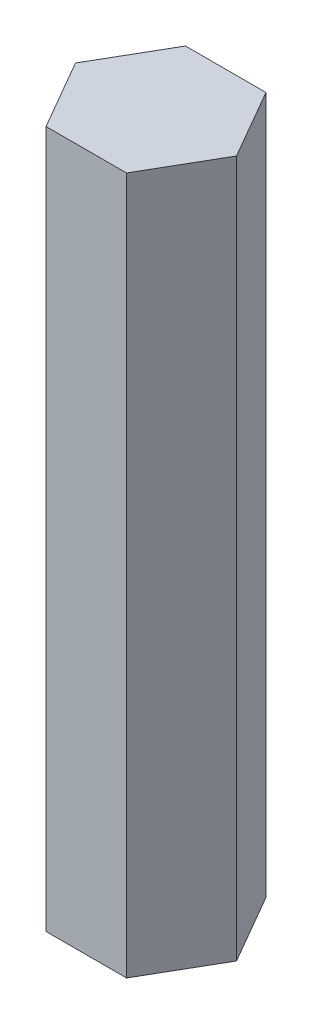
ISO-10303-21;
HEADER;
FILE_DESCRIPTION(('STEP AP214'),'2;1');
FILE_NAME('part.step','',(''),(''),'','','');
FILE_SCHEMA(('AUTOMOTIVE_DESIGN { 1 0 10303 214 1 1 1 1 }'));
ENDSEC;
DATA;
#1=APPLICATION_CONTEXT('core data for automotive mechanical design processes');
#2=APPLICATION_PROTOCOL_DEFINITION('international standard','automotive_design',2000,#1);
#3=PRODUCT_CONTEXT('',#1,'mechanical');
#4=PRODUCT('Part','Part','',(#3));
#5=PRODUCT_RELATED_PRODUCT_CATEGORY('part','',(#4));
#6=PRODUCT_DEFINITION_FORMATION('','',#4);
#7=PRODUCT_DEFINITION_CONTEXT('part definition',#1,'design');
#8=PRODUCT_DEFINITION('design','',#6,#7);
#9=PRODUCT_DEFINITION_SHAPE('','',#8);
#10=(LENGTH_UNIT() NAMED_UNIT(*) SI_UNIT(.MILLI.,.METRE.));
#11=(NAMED_UNIT(*) PLANE_ANGLE_UNIT() SI_UNIT($,.RADIAN.));
#12=(NAMED_UNIT(*) SI_UNIT($,.STERADIAN.) SOLID_ANGLE_UNIT());
#13=UNCERTAINTY_MEASURE_WITH_UNIT(LENGTH_MEASURE(1.E-05),#10,'distance_accuracy_value','');
#14=(GEOMETRIC_REPRESENTATION_CONTEXT(3) GLOBAL_UNCERTAINTY_ASSIGNED_CONTEXT((#13)) GLOBAL_UNIT_ASSIGNED_CONTEXT((#10,
#11,#12)) REPRESENTATION_CONTEXT('',''));
#15=CARTESIAN_POINT('',(0.,0.,0.));
#16=DIRECTION('',(0.,0.,1.));
#17=DIRECTION('',(1.,0.,0.));
#18=AXIS2_PLACEMENT_3D('',#15,#16,#17);
#19=CARTESIAN_POINT('',(2.3094010767585,40.,4.));
#20=DIRECTION('',(-0.866025403784439,0.,-0.5));
#21=DIRECTION('',(-0.5,0.,0.866025403784439));
#22=AXIS2_PLACEMENT_3D('',#19,#20,#21);
#23=PLANE('',#22);
#24=DIRECTION('',(0.5,0.,-0.866025403784439));
#25=VECTOR('',#24,1.);
#26=CARTESIAN_POINT('',(2.3094010767585,0.,4.));
#27=LINE('',#26,#25);
#28=CARTESIAN_POINT('',(2.3094010767585,0.,4.));
#29=VERTEX_POINT('',#28);
#30=CARTESIAN_POINT('',(4.61880215351701,0.,0.));
#31=VERTEX_POINT('',#30);
#32=EDGE_CURVE('E117',#29,#31,#27,.T.);
#33=ORIENTED_EDGE('',*,*,#32,.T.);
#34=DIRECTION('',(0.,-1.,0.));
#35=VECTOR('',#34,1.);
#36=CARTESIAN_POINT('',(4.61880215351701,40.,0.));
#37=LINE('',#36,#35);
#38=CARTESIAN_POINT('',(4.61880215351701,40.,0.));
#39=VERTEX_POINT('',#38);
#40=EDGE_CURVE('E11',#39,#31,#37,.T.);
#41=ORIENTED_EDGE('',*,*,#40,.F.);
#42=DIRECTION('',(0.5,0.,-0.866025403784439));
#43=VECTOR('',#42,1.);
#44=CARTESIAN_POINT('',(2.3094010767585,40.,4.));
#45=LINE('',#44,#43);
#46=CARTESIAN_POINT('',(2.3094010767585,40.,4.));
#47=VERTEX_POINT('',#46);
#48=EDGE_CURVE('E127',#47,#39,#45,.T.);
#49=ORIENTED_EDGE('',*,*,#48,.F.);
#50=DIRECTION('',(0.,-1.,0.));
#51=VECTOR('',#50,1.);
#52=CARTESIAN_POINT('',(2.3094010767585,40.,4.));
#53=LINE('',#52,#51);
#54=EDGE_CURVE('E113',#47,#29,#53,.T.);
#55=ORIENTED_EDGE('',*,*,#54,.T.);
#56=EDGE_LOOP('',(#33,#41,#49,#55));
#57=FACE_BOUND('',#56,.T.);
#58=ADVANCED_FACE('F33',(#57),#23,.F.);
#59=CARTESIAN_POINT('',(4.61880215351701,40.,0.));
#60=DIRECTION('',(-0.866025403784438,0.,0.5));
#61=DIRECTION('',(0.5,0.,0.866025403784439));
#62=AXIS2_PLACEMENT_3D('',#59,#60,#61);
#63=PLANE('',#62);
#64=DIRECTION('',(-0.5,0.,-0.866025403784438));
#65=VECTOR('',#64,1.);
#66=CARTESIAN_POINT('',(4.61880215351701,0.,0.));
#67=LINE('',#66,#65);
#68=CARTESIAN_POINT('',(2.3094010767585,0.,-4.00000000000001));
#69=VERTEX_POINT('',#68);
#70=EDGE_CURVE('E120',#31,#69,#67,.T.);
#71=ORIENTED_EDGE('',*,*,#70,.T.);
#72=DIRECTION('',(0.,-1.,0.));
#73=VECTOR('',#72,1.);
#74=CARTESIAN_POINT('',(2.3094010767585,40.,-4.00000000000001));
#75=LINE('',#74,#73);
#76=CARTESIAN_POINT('',(2.3094010767585,40.,-4.00000000000001));
#77=VERTEX_POINT('',#76);
#78=EDGE_CURVE('E41',#77,#69,#75,.T.);
#79=ORIENTED_EDGE('',*,*,#78,.F.);
#80=DIRECTION('',(-0.5,0.,-0.866025403784438));
#81=VECTOR('',#80,1.);
#82=CARTESIAN_POINT('',(4.61880215351701,40.,0.));
#83=LINE('',#82,#81);
#84=EDGE_CURVE('E86',#39,#77,#83,.T.);
#85=ORIENTED_EDGE('',*,*,#84,.F.);
#86=ORIENTED_EDGE('',*,*,#40,.T.);
#87=EDGE_LOOP('',(#71,#79,#85,#86));
#88=FACE_BOUND('',#87,.T.);
#89=ADVANCED_FACE('F151',(#88),#63,.F.);
#90=CARTESIAN_POINT('',(2.3094010767585,40.,-4.00000000000001));
#91=DIRECTION('',(0.,0.,1.));
#92=DIRECTION('',(1.,0.,0.));
#93=AXIS2_PLACEMENT_3D('',#90,#91,#92);
#94=PLANE('',#93);
#95=DIRECTION('',(-1.,0.,0.));
#96=VECTOR('',#95,1.);
#97=CARTESIAN_POINT('',(2.3094010767585,0.,-4.00000000000001));
#98=LINE('',#97,#96);
#99=CARTESIAN_POINT('',(-2.3094010767585,0.,-4.00000000000001));
#100=VERTEX_POINT('',#99);
#101=EDGE_CURVE('E122',#69,#100,#98,.T.);
#102=ORIENTED_EDGE('',*,*,#101,.T.);
#103=DIRECTION('',(0.,-1.,0.));
#104=VECTOR('',#103,1.);
#105=CARTESIAN_POINT('',(-2.3094010767585,40.,-4.00000000000001));
#106=LINE('',#105,#104);
#107=CARTESIAN_POINT('',(-2.3094010767585,40.,-4.00000000000001));
#108=VERTEX_POINT('',#107);
#109=EDGE_CURVE('E108',#108,#100,#106,.T.);
#110=ORIENTED_EDGE('',*,*,#109,.F.);
#111=DIRECTION('',(-1.,0.,0.));
#112=VECTOR('',#111,1.);
#113=CARTESIAN_POINT('',(2.3094010767585,40.,-4.00000000000001));
#114=LINE('',#113,#112);
#115=EDGE_CURVE('E99',#77,#108,#114,.T.);
#116=ORIENTED_EDGE('',*,*,#115,.F.);
#117=ORIENTED_EDGE('',*,*,#78,.T.);
#118=EDGE_LOOP('',(#102,#110,#116,#117));
#119=FACE_BOUND('',#118,.T.);
#120=ADVANCED_FACE('F133',(#119),#94,.F.);
#121=CARTESIAN_POINT('',(-2.3094010767585,40.,-4.00000000000001));
#122=DIRECTION('',(0.866025403784439,0.,0.5));
#123=DIRECTION('',(0.5,0.,-0.866025403784439));
#124=AXIS2_PLACEMENT_3D('',#121,#122,#123);
#125=PLANE('',#124);
#126=DIRECTION('',(-0.5,0.,0.866025403784439));
#127=VECTOR('',#126,1.);
#128=CARTESIAN_POINT('',(-2.3094010767585,0.,-4.00000000000001));
#129=LINE('',#128,#127);
#130=CARTESIAN_POINT('',(-4.61880215351701,0.,0.));
#131=VERTEX_POINT('',#130);
#132=EDGE_CURVE('E107',#100,#131,#129,.T.);
#133=ORIENTED_EDGE('',*,*,#132,.T.);
#134=DIRECTION('',(0.,-1.,0.));
#135=VECTOR('',#134,1.);
#136=CARTESIAN_POINT('',(-4.61880215351701,40.,0.));
#137=LINE('',#136,#135);
#138=CARTESIAN_POINT('',(-4.61880215351701,40.,0.));
#139=VERTEX_POINT('',#138);
#140=EDGE_CURVE('E104',#139,#131,#137,.T.);
#141=ORIENTED_EDGE('',*,*,#140,.F.);
#142=DIRECTION('',(-0.5,0.,0.866025403784439));
#143=VECTOR('',#142,1.);
#144=CARTESIAN_POINT('',(-2.3094010767585,40.,-4.00000000000001));
#145=LINE('',#144,#143);
#146=EDGE_CURVE('E93',#108,#139,#145,.T.);
#147=ORIENTED_EDGE('',*,*,#146,.F.);
#148=ORIENTED_EDGE('',*,*,#109,.T.);
#149=EDGE_LOOP('',(#133,#141,#147,#148));
#150=FACE_BOUND('',#149,.T.);
#151=ADVANCED_FACE('F105',(#150),#125,.F.);
#152=CARTESIAN_POINT('',(-4.61880215351701,40.,0.));
#153=DIRECTION('',(0.866025403784439,0.,-0.5));
#154=DIRECTION('',(-0.5,0.,-0.866025403784439));
#155=AXIS2_PLACEMENT_3D('',#152,#153,#154);
#156=PLANE('',#155);
#157=DIRECTION('',(0.5,0.,0.866025403784439));
#158=VECTOR('',#157,1.);
#159=CARTESIAN_POINT('',(-4.61880215351701,0.,0.));
#160=LINE('',#159,#158);
#161=CARTESIAN_POINT('',(-2.3094010767585,0.,4.00000000000001));
#162=VERTEX_POINT('',#161);
#163=EDGE_CURVE('E72',#131,#162,#160,.T.);
#164=ORIENTED_EDGE('',*,*,#163,.T.);
#165=DIRECTION('',(0.,-1.,0.));
#166=VECTOR('',#165,1.);
#167=CARTESIAN_POINT('',(-2.3094010767585,40.,4.00000000000001));
#168=LINE('',#167,#166);
#169=CARTESIAN_POINT('',(-2.3094010767585,40.,4.00000000000001));
#170=VERTEX_POINT('',#169);
#171=EDGE_CURVE('E109',#170,#162,#168,.T.);
#172=ORIENTED_EDGE('',*,*,#171,.F.);
#173=DIRECTION('',(0.5,0.,0.866025403784439));
#174=VECTOR('',#173,1.);
#175=CARTESIAN_POINT('',(-4.61880215351701,40.,0.));
#176=LINE('',#175,#174);
#177=EDGE_CURVE('E97',#139,#170,#176,.T.);
#178=ORIENTED_EDGE('',*,*,#177,.F.);
#179=ORIENTED_EDGE('',*,*,#140,.T.);
#180=EDGE_LOOP('',(#164,#172,#178,#179));
#181=FACE_BOUND('',#180,.T.);
#182=ADVANCED_FACE('F111',(#181),#156,.F.);
#183=CARTESIAN_POINT('',(-2.3094010767585,40.,4.00000000000001));
#184=DIRECTION('',(0.,0.,-1.));
#185=DIRECTION('',(-1.,0.,0.));
#186=AXIS2_PLACEMENT_3D('',#183,#184,#185);
#187=PLANE('',#186);
#188=DIRECTION('',(1.,0.,0.));
#189=VECTOR('',#188,1.);
#190=CARTESIAN_POINT('',(-2.3094010767585,0.,4.00000000000001));
#191=LINE('',#190,#189);
#192=EDGE_CURVE('E78',#162,#29,#191,.T.);
#193=ORIENTED_EDGE('',*,*,#192,.T.);
#194=ORIENTED_EDGE('',*,*,#54,.F.);
#195=DIRECTION('',(1.,0.,0.));
#196=VECTOR('',#195,1.);
#197=CARTESIAN_POINT('',(-2.3094010767585,40.,4.00000000000001));
#198=LINE('',#197,#196);
#199=EDGE_CURVE('E49',#170,#47,#198,.T.);
#200=ORIENTED_EDGE('',*,*,#199,.F.);
#201=ORIENTED_EDGE('',*,*,#171,.T.);
#202=EDGE_LOOP('',(#193,#194,#200,#201));
#203=FACE_BOUND('',#202,.T.);
#204=ADVANCED_FACE('F140',(#203),#187,.F.);
#205=CARTESIAN_POINT('',(0.,40.,0.));
#206=DIRECTION('',(0.,1.,0.));
#207=DIRECTION('',(0.,0.,1.));
#208=AXIS2_PLACEMENT_3D('',#205,#206,#207);
#209=PLANE('',#208);
#210=ORIENTED_EDGE('',*,*,#48,.T.);
#211=ORIENTED_EDGE('',*,*,#84,.T.);
#212=ORIENTED_EDGE('',*,*,#115,.T.);
#213=ORIENTED_EDGE('',*,*,#146,.T.);
#214=ORIENTED_EDGE('',*,*,#177,.T.);
#215=ORIENTED_EDGE('',*,*,#199,.T.);
#216=EDGE_LOOP('',(#210,#211,#212,#213,#214,#215));
#217=FACE_BOUND('',#216,.T.);
#218=ADVANCED_FACE('F95',(#217),#209,.T.);
#219=CARTESIAN_POINT('',(0.,0.,0.));
#220=DIRECTION('',(0.,1.,0.));
#221=DIRECTION('',(0.,0.,1.));
#222=AXIS2_PLACEMENT_3D('',#219,#220,#221);
#223=PLANE('',#222);
#224=ORIENTED_EDGE('',*,*,#32,.F.);
#225=ORIENTED_EDGE('',*,*,#192,.F.);
#226=ORIENTED_EDGE('',*,*,#163,.F.);
#227=ORIENTED_EDGE('',*,*,#132,.F.);
#228=ORIENTED_EDGE('',*,*,#101,.F.);
#229=ORIENTED_EDGE('',*,*,#70,.F.);
#230=EDGE_LOOP('',(#224,#225,#226,#227,#228,#229));
#231=FACE_BOUND('',#230,.T.);
#232=ADVANCED_FACE('F136',(#231),#223,.F.);
#233=CLOSED_SHELL('',(#58,#89,#120,#151,#182,#204,#218,#232));
#234=MANIFOLD_SOLID_BREP('B2',#233);
#235=ADVANCED_BREP_SHAPE_REPRESENTATION('',(#18,#234),#14);
#236=SHAPE_DEFINITION_REPRESENTATION(#9,#235);
ENDSEC;
END-ISO-10303-21;
